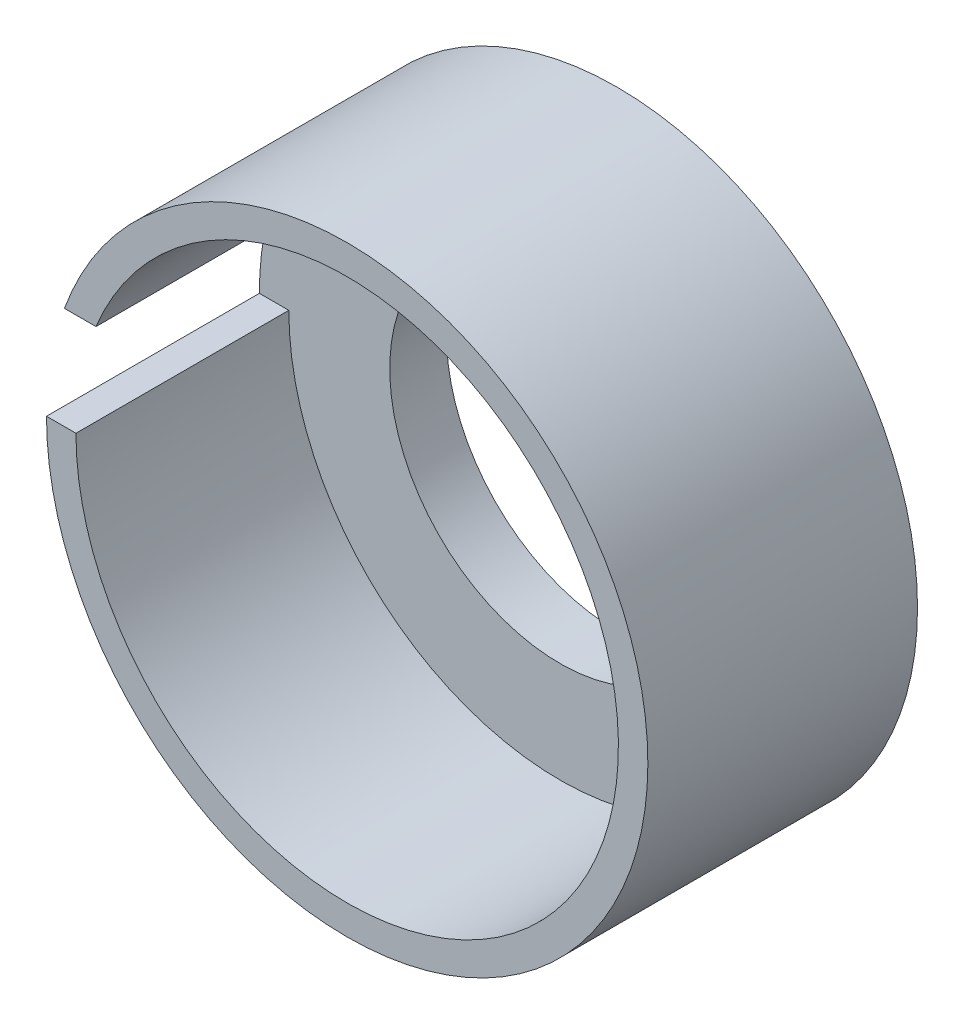
ISO-10303-21;
HEADER;
FILE_DESCRIPTION(('STEP AP214'),'2;1');
FILE_NAME('part.step','',(''),(''),'','','');
FILE_SCHEMA(('AUTOMOTIVE_DESIGN { 1 0 10303 214 1 1 1 1 }'));
ENDSEC;
DATA;
#1=APPLICATION_CONTEXT('core data for automotive mechanical design processes');
#2=APPLICATION_PROTOCOL_DEFINITION('international standard','automotive_design',2000,#1);
#3=PRODUCT_CONTEXT('',#1,'mechanical');
#4=PRODUCT('Part','Part','',(#3));
#5=PRODUCT_RELATED_PRODUCT_CATEGORY('part','',(#4));
#6=PRODUCT_DEFINITION_FORMATION('','',#4);
#7=PRODUCT_DEFINITION_CONTEXT('part definition',#1,'design');
#8=PRODUCT_DEFINITION('design','',#6,#7);
#9=PRODUCT_DEFINITION_SHAPE('','',#8);
#10=(LENGTH_UNIT() NAMED_UNIT(*) SI_UNIT(.MILLI.,.METRE.));
#11=(NAMED_UNIT(*) PLANE_ANGLE_UNIT() SI_UNIT($,.RADIAN.));
#12=(NAMED_UNIT(*) SI_UNIT($,.STERADIAN.) SOLID_ANGLE_UNIT());
#13=UNCERTAINTY_MEASURE_WITH_UNIT(LENGTH_MEASURE(1.E-05),#10,'distance_accuracy_value','');
#14=(GEOMETRIC_REPRESENTATION_CONTEXT(3) GLOBAL_UNCERTAINTY_ASSIGNED_CONTEXT((#13)) GLOBAL_UNIT_ASSIGNED_CONTEXT((#10,
#11,#12)) REPRESENTATION_CONTEXT('',''));
#15=CARTESIAN_POINT('',(0.,0.,0.));
#16=DIRECTION('',(0.,0.,1.));
#17=DIRECTION('',(1.,0.,0.));
#18=AXIS2_PLACEMENT_3D('',#15,#16,#17);
#19=CARTESIAN_POINT('',(0.,0.,8.));
#20=DIRECTION('',(0.,0.,1.));
#21=DIRECTION('',(1.,0.,0.));
#22=AXIS2_PLACEMENT_3D('',#19,#20,#21);
#23=PLANE('',#22);
#24=CARTESIAN_POINT('',(0.,0.,8.));
#25=DIRECTION('',(0.,0.,1.));
#26=DIRECTION('',(1.,0.,0.));
#27=AXIS2_PLACEMENT_3D('',#24,#25,#26);
#28=CIRCLE('',#27,24.);
#29=CARTESIAN_POINT('',(24.,0.,8.));
#30=VERTEX_POINT('',#29);
#31=EDGE_CURVE('E100',#30,#30,#28,.T.);
#32=ORIENTED_EDGE('',*,*,#31,.F.);
#33=EDGE_LOOP('',(#32));
#34=FACE_BOUND('',#33,.T.);
#35=CARTESIAN_POINT('',(0.,0.,8.));
#36=DIRECTION('',(0.,0.,1.));
#37=DIRECTION('',(1.,0.,0.));
#38=AXIS2_PLACEMENT_3D('',#35,#36,#37);
#39=CIRCLE('',#38,38.225);
#40=CARTESIAN_POINT('',(-38.225,0.,8.));
#41=VERTEX_POINT('',#40);
#42=CARTESIAN_POINT('',(-35.3977851063774,14.4273155702206,8.));
#43=VERTEX_POINT('',#42);
#44=EDGE_CURVE('E53',#41,#43,#39,.T.);
#45=ORIENTED_EDGE('',*,*,#44,.T.);
#46=DIRECTION('',(-1.,0.,0.));
#47=VECTOR('',#46,1.);
#48=CARTESIAN_POINT('',(2.02670498314078E-13,14.4273155702201,8.));
#49=LINE('',#48,#47);
#50=CARTESIAN_POINT('',(-39.8433581721881,14.4273155702206,8.));
#51=VERTEX_POINT('',#50);
#52=EDGE_CURVE('E96',#43,#51,#49,.T.);
#53=ORIENTED_EDGE('',*,*,#52,.T.);
#54=CARTESIAN_POINT('',(0.,0.,8.));
#55=DIRECTION('',(0.,0.,1.));
#56=DIRECTION('',(1.,0.,0.));
#57=AXIS2_PLACEMENT_3D('',#54,#55,#56);
#58=CIRCLE('',#57,42.375);
#59=CARTESIAN_POINT('',(-42.375,0.,8.));
#60=VERTEX_POINT('',#59);
#61=EDGE_CURVE('E11',#51,#60,#58,.T.);
#62=ORIENTED_EDGE('',*,*,#61,.T.);
#63=DIRECTION('',(-1.,0.,0.));
#64=VECTOR('',#63,1.);
#65=CARTESIAN_POINT('',(0.,0.,8.));
#66=LINE('',#65,#64);
#67=EDGE_CURVE('E57',#41,#60,#66,.T.);
#68=ORIENTED_EDGE('',*,*,#67,.F.);
#69=EDGE_LOOP('',(#45,#53,#62,#68));
#70=FACE_BOUND('',#69,.T.);
#71=ADVANCED_FACE('F36',(#34,#70),#23,.T.);
#72=CARTESIAN_POINT('',(0.,0.,8.));
#73=DIRECTION('',(0.,0.,-1.));
#74=DIRECTION('',(-1.,0.,0.));
#75=AXIS2_PLACEMENT_3D('',#72,#73,#74);
#76=CYLINDRICAL_SURFACE('',#75,42.375);
#77=ORIENTED_EDGE('',*,*,#61,.F.);
#78=DIRECTION('',(0.,0.,-1.));
#79=VECTOR('',#78,1.);
#80=CARTESIAN_POINT('',(-39.8433581721881,14.4273155702206,38.));
#81=LINE('',#80,#79);
#82=CARTESIAN_POINT('',(-39.8433581721881,14.4273155702206,38.));
#83=VERTEX_POINT('',#82);
#84=EDGE_CURVE('E108',#83,#51,#81,.T.);
#85=ORIENTED_EDGE('',*,*,#84,.F.);
#86=CARTESIAN_POINT('',(0.,0.,38.));
#87=DIRECTION('',(0.,0.,1.));
#88=DIRECTION('',(1.,0.,0.));
#89=AXIS2_PLACEMENT_3D('',#86,#87,#88);
#90=CIRCLE('',#89,42.375);
#91=CARTESIAN_POINT('',(-42.375,0.,38.));
#92=VERTEX_POINT('',#91);
#93=EDGE_CURVE('E91',#92,#83,#90,.T.);
#94=ORIENTED_EDGE('',*,*,#93,.F.);
#95=DIRECTION('',(0.,0.,-1.));
#96=VECTOR('',#95,1.);
#97=CARTESIAN_POINT('',(-42.375,0.,38.));
#98=LINE('',#97,#96);
#99=EDGE_CURVE('E83',#92,#60,#98,.T.);
#100=ORIENTED_EDGE('',*,*,#99,.T.);
#101=EDGE_LOOP('',(#77,#85,#94,#100));
#102=FACE_BOUND('',#101,.T.);
#103=CARTESIAN_POINT('',(0.,0.,0.));
#104=DIRECTION('',(0.,0.,1.));
#105=DIRECTION('',(1.,0.,0.));
#106=AXIS2_PLACEMENT_3D('',#103,#104,#105);
#107=CIRCLE('',#106,42.375);
#108=CARTESIAN_POINT('',(42.375,0.,0.));
#109=VERTEX_POINT('',#108);
#110=EDGE_CURVE('E45',#109,#109,#107,.T.);
#111=ORIENTED_EDGE('',*,*,#110,.T.);
#112=EDGE_LOOP('',(#111));
#113=FACE_BOUND('',#112,.T.);
#114=ADVANCED_FACE('F38',(#102,#113),#76,.T.);
#115=CARTESIAN_POINT('',(0.,0.,0.));
#116=DIRECTION('',(0.,0.,1.));
#117=DIRECTION('',(1.,0.,0.));
#118=AXIS2_PLACEMENT_3D('',#115,#116,#117);
#119=PLANE('',#118);
#120=CARTESIAN_POINT('',(0.,0.,0.));
#121=DIRECTION('',(0.,0.,1.));
#122=DIRECTION('',(1.,0.,0.));
#123=AXIS2_PLACEMENT_3D('',#120,#121,#122);
#124=CIRCLE('',#123,24.);
#125=CARTESIAN_POINT('',(24.,0.,0.));
#126=VERTEX_POINT('',#125);
#127=EDGE_CURVE('E40',#126,#126,#124,.T.);
#128=ORIENTED_EDGE('',*,*,#127,.T.);
#129=EDGE_LOOP('',(#128));
#130=FACE_BOUND('',#129,.T.);
#131=ORIENTED_EDGE('',*,*,#110,.F.);
#132=EDGE_LOOP('',(#131));
#133=FACE_BOUND('',#132,.T.);
#134=ADVANCED_FACE('F115',(#130,#133),#119,.F.);
#135=CARTESIAN_POINT('',(0.,0.,38.));
#136=DIRECTION('',(0.,0.,-1.));
#137=DIRECTION('',(-1.,0.,0.));
#138=AXIS2_PLACEMENT_3D('',#135,#136,#137);
#139=CYLINDRICAL_SURFACE('',#138,38.225);
#140=ORIENTED_EDGE('',*,*,#44,.F.);
#141=DIRECTION('',(0.,0.,-1.));
#142=VECTOR('',#141,1.);
#143=CARTESIAN_POINT('',(-38.225,0.,38.));
#144=LINE('',#143,#142);
#145=CARTESIAN_POINT('',(-38.225,0.,38.));
#146=VERTEX_POINT('',#145);
#147=EDGE_CURVE('E76',#146,#41,#144,.T.);
#148=ORIENTED_EDGE('',*,*,#147,.F.);
#149=CARTESIAN_POINT('',(0.,0.,38.));
#150=DIRECTION('',(0.,0.,1.));
#151=DIRECTION('',(1.,0.,0.));
#152=AXIS2_PLACEMENT_3D('',#149,#150,#151);
#153=CIRCLE('',#152,38.225);
#154=CARTESIAN_POINT('',(-35.3977851063774,14.4273155702206,38.));
#155=VERTEX_POINT('',#154);
#156=EDGE_CURVE('E80',#146,#155,#153,.T.);
#157=ORIENTED_EDGE('',*,*,#156,.T.);
#158=DIRECTION('',(0.,0.,-1.));
#159=VECTOR('',#158,1.);
#160=CARTESIAN_POINT('',(-35.3977851063774,14.4273155702206,38.));
#161=LINE('',#160,#159);
#162=EDGE_CURVE('E104',#155,#43,#161,.T.);
#163=ORIENTED_EDGE('',*,*,#162,.T.);
#164=EDGE_LOOP('',(#140,#148,#157,#163));
#165=FACE_BOUND('',#164,.T.);
#166=ADVANCED_FACE('F78',(#165),#139,.F.);
#167=CARTESIAN_POINT('',(0.,0.,38.));
#168=DIRECTION('',(0.,-1.,0.));
#169=DIRECTION('',(0.,0.,-1.));
#170=AXIS2_PLACEMENT_3D('',#167,#168,#169);
#171=PLANE('',#170);
#172=ORIENTED_EDGE('',*,*,#67,.T.);
#173=ORIENTED_EDGE('',*,*,#99,.F.);
#174=DIRECTION('',(-1.,0.,0.));
#175=VECTOR('',#174,1.);
#176=CARTESIAN_POINT('',(0.,0.,38.));
#177=LINE('',#176,#175);
#178=EDGE_CURVE('E86',#146,#92,#177,.T.);
#179=ORIENTED_EDGE('',*,*,#178,.F.);
#180=ORIENTED_EDGE('',*,*,#147,.T.);
#181=EDGE_LOOP('',(#172,#173,#179,#180));
#182=FACE_BOUND('',#181,.T.);
#183=ADVANCED_FACE('F87',(#182),#171,.F.);
#184=CARTESIAN_POINT('',(2.02670498314078E-13,14.4273155702201,38.));
#185=DIRECTION('',(0.,-1.,0.));
#186=DIRECTION('',(1.,0.,0.));
#187=AXIS2_PLACEMENT_3D('',#184,#185,#186);
#188=PLANE('',#187);
#189=ORIENTED_EDGE('',*,*,#52,.F.);
#190=ORIENTED_EDGE('',*,*,#162,.F.);
#191=DIRECTION('',(-1.,0.,0.));
#192=VECTOR('',#191,1.);
#193=CARTESIAN_POINT('',(2.02670498314078E-13,14.4273155702201,38.));
#194=LINE('',#193,#192);
#195=EDGE_CURVE('E95',#155,#83,#194,.T.);
#196=ORIENTED_EDGE('',*,*,#195,.T.);
#197=ORIENTED_EDGE('',*,*,#84,.T.);
#198=EDGE_LOOP('',(#189,#190,#196,#197));
#199=FACE_BOUND('',#198,.T.);
#200=ADVANCED_FACE('F134',(#199),#188,.T.);
#201=CARTESIAN_POINT('',(0.,0.,38.));
#202=DIRECTION('',(0.,0.,1.));
#203=DIRECTION('',(1.,0.,0.));
#204=AXIS2_PLACEMENT_3D('',#201,#202,#203);
#205=PLANE('',#204);
#206=ORIENTED_EDGE('',*,*,#156,.F.);
#207=ORIENTED_EDGE('',*,*,#178,.T.);
#208=ORIENTED_EDGE('',*,*,#93,.T.);
#209=ORIENTED_EDGE('',*,*,#195,.F.);
#210=EDGE_LOOP('',(#206,#207,#208,#209));
#211=FACE_BOUND('',#210,.T.);
#212=ADVANCED_FACE('F93',(#211),#205,.T.);
#213=CARTESIAN_POINT('',(0.,0.,-12.));
#214=DIRECTION('',(0.,0.,1.));
#215=DIRECTION('',(1.,0.,0.));
#216=AXIS2_PLACEMENT_3D('',#213,#214,#215);
#217=CYLINDRICAL_SURFACE('',#216,24.);
#218=ORIENTED_EDGE('',*,*,#31,.T.);
#219=EDGE_LOOP('',(#218));
#220=FACE_BOUND('',#219,.T.);
#221=ORIENTED_EDGE('',*,*,#127,.F.);
#222=EDGE_LOOP('',(#221));
#223=FACE_BOUND('',#222,.T.);
#224=ADVANCED_FACE('F140',(#220,#223),#217,.F.);
#225=CLOSED_SHELL('',(#71,#114,#134,#166,#183,#200,#212,#224));
#226=MANIFOLD_SOLID_BREP('B2',#225);
#227=ADVANCED_BREP_SHAPE_REPRESENTATION('',(#18,#226),#14);
#228=SHAPE_DEFINITION_REPRESENTATION(#9,#227);
ENDSEC;
END-ISO-10303-21;
